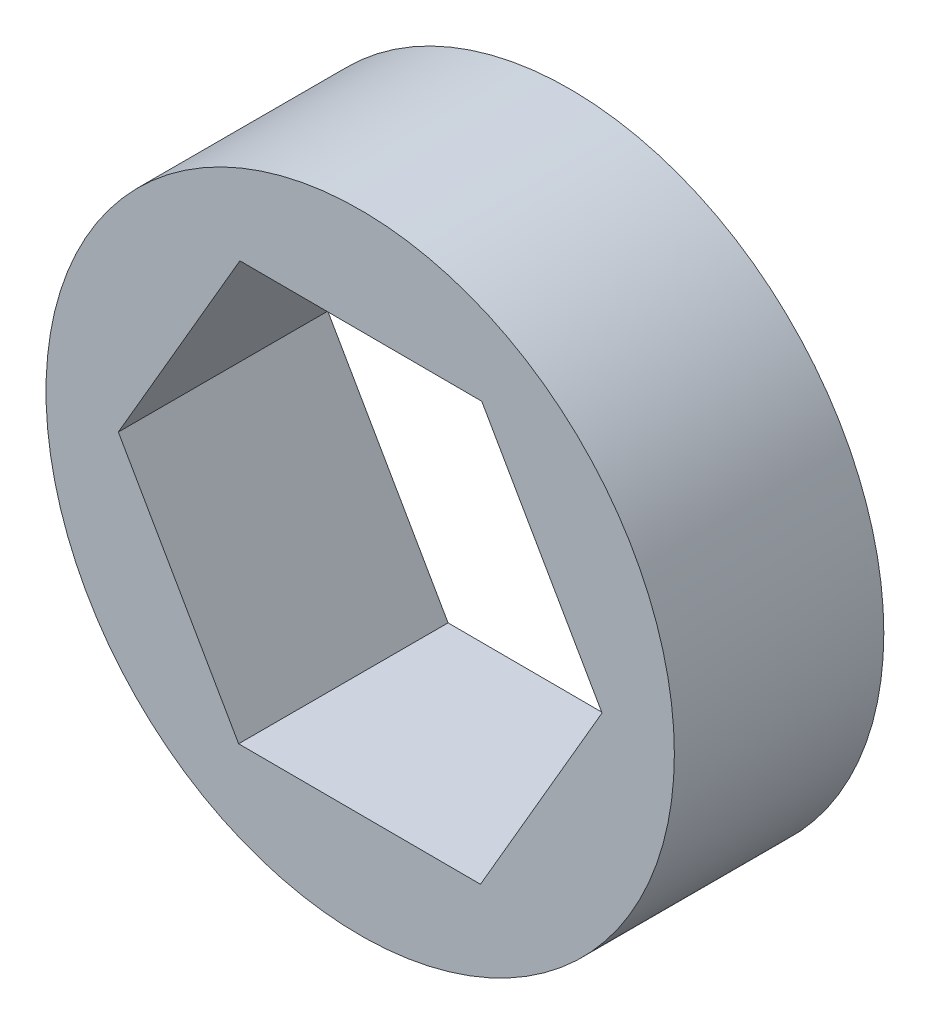
ISO-10303-21;
HEADER;
FILE_DESCRIPTION(('STEP AP214'),'2;1');
FILE_NAME('part.step','',(''),(''),'','','');
FILE_SCHEMA(('AUTOMOTIVE_DESIGN { 1 0 10303 214 1 1 1 1 }'));
ENDSEC;
DATA;
#1=APPLICATION_CONTEXT('core data for automotive mechanical design processes');
#2=APPLICATION_PROTOCOL_DEFINITION('international standard','automotive_design',2000,#1);
#3=PRODUCT_CONTEXT('',#1,'mechanical');
#4=PRODUCT('Part','Part','',(#3));
#5=PRODUCT_RELATED_PRODUCT_CATEGORY('part','',(#4));
#6=PRODUCT_DEFINITION_FORMATION('','',#4);
#7=PRODUCT_DEFINITION_CONTEXT('part definition',#1,'design');
#8=PRODUCT_DEFINITION('design','',#6,#7);
#9=PRODUCT_DEFINITION_SHAPE('','',#8);
#10=(LENGTH_UNIT() NAMED_UNIT(*) SI_UNIT(.MILLI.,.METRE.));
#11=(NAMED_UNIT(*) PLANE_ANGLE_UNIT() SI_UNIT($,.RADIAN.));
#12=(NAMED_UNIT(*) SI_UNIT($,.STERADIAN.) SOLID_ANGLE_UNIT());
#13=UNCERTAINTY_MEASURE_WITH_UNIT(LENGTH_MEASURE(1.E-05),#10,'distance_accuracy_value','');
#14=(GEOMETRIC_REPRESENTATION_CONTEXT(3) GLOBAL_UNCERTAINTY_ASSIGNED_CONTEXT((#13)) GLOBAL_UNIT_ASSIGNED_CONTEXT((#10,
#11,#12)) REPRESENTATION_CONTEXT('',''));
#15=CARTESIAN_POINT('',(0.,0.,0.));
#16=DIRECTION('',(0.,0.,1.));
#17=DIRECTION('',(1.,0.,0.));
#18=AXIS2_PLACEMENT_3D('',#15,#16,#17);
#19=CARTESIAN_POINT('',(0.,0.,6.35));
#20=DIRECTION('',(0.,0.,1.));
#21=DIRECTION('',(1.,0.,0.));
#22=AXIS2_PLACEMENT_3D('',#19,#20,#21);
#23=PLANE('',#22);
#24=CARTESIAN_POINT('',(0.,0.,6.35));
#25=DIRECTION('',(0.,0.,1.));
#26=DIRECTION('',(1.,0.,0.));
#27=AXIS2_PLACEMENT_3D('',#24,#25,#26);
#28=CIRCLE('',#27,9.525);
#29=CARTESIAN_POINT('',(9.525,0.,6.35));
#30=VERTEX_POINT('',#29);
#31=EDGE_CURVE('E11',#30,#30,#28,.T.);
#32=ORIENTED_EDGE('',*,*,#31,.T.);
#33=EDGE_LOOP('',(#32));
#34=FACE_BOUND('',#33,.T.);
#35=DIRECTION('',(0.502611333572125,0.864512491156056,0.));
#36=VECTOR('',#35,1.);
#37=CARTESIAN_POINT('',(3.64699361036975,-6.36103536692381,6.35));
#38=LINE('',#37,#36);
#39=CARTESIAN_POINT('',(3.64699361036975,-6.36103536692381,6.35));
#40=VERTEX_POINT('',#39);
#41=CARTESIAN_POINT('',(7.33231502731217,-0.0221285694421737,6.35));
#42=VERTEX_POINT('',#41);
#43=EDGE_CURVE('E100',#40,#42,#38,.T.);
#44=ORIENTED_EDGE('',*,*,#43,.F.);
#45=DIRECTION('',(0.999995446016177,-0.00301793752540637,0.));
#46=VECTOR('',#45,1.);
#47=CARTESIAN_POINT('',(-3.68532141694241,-6.33890679748164,6.35));
#48=LINE('',#47,#46);
#49=CARTESIAN_POINT('',(-3.68532141694241,-6.33890679748164,6.35));
#50=VERTEX_POINT('',#49);
#51=EDGE_CURVE('E92',#50,#40,#48,.T.);
#52=ORIENTED_EDGE('',*,*,#51,.F.);
#53=DIRECTION('',(0.497384112444053,-0.867530428681462,0.));
#54=VECTOR('',#53,1.);
#55=CARTESIAN_POINT('',(-7.33231502731217,0.022128569442172,6.35));
#56=LINE('',#55,#54);
#57=CARTESIAN_POINT('',(-7.33231502731217,0.022128569442172,6.35));
#58=VERTEX_POINT('',#57);
#59=EDGE_CURVE('E120',#58,#50,#56,.T.);
#60=ORIENTED_EDGE('',*,*,#59,.F.);
#61=DIRECTION('',(-0.502611333572125,-0.864512491156056,0.));
#62=VECTOR('',#61,1.);
#63=CARTESIAN_POINT('',(-3.64699361036976,6.36103536692381,6.35));
#64=LINE('',#63,#62);
#65=CARTESIAN_POINT('',(-3.64699361036976,6.36103536692381,6.35));
#66=VERTEX_POINT('',#65);
#67=EDGE_CURVE('E118',#66,#58,#64,.T.);
#68=ORIENTED_EDGE('',*,*,#67,.F.);
#69=DIRECTION('',(-0.999995446016177,0.00301793752540602,0.));
#70=VECTOR('',#69,1.);
#71=CARTESIAN_POINT('',(3.68532141694241,6.33890679748164,6.35));
#72=LINE('',#71,#70);
#73=CARTESIAN_POINT('',(3.68532141694241,6.33890679748164,6.35));
#74=VERTEX_POINT('',#73);
#75=EDGE_CURVE('E114',#74,#66,#72,.T.);
#76=ORIENTED_EDGE('',*,*,#75,.F.);
#77=DIRECTION('',(-0.497384112444053,0.867530428681462,0.));
#78=VECTOR('',#77,1.);
#79=CARTESIAN_POINT('',(7.33231502731217,-0.0221285694421737,6.35));
#80=LINE('',#79,#78);
#81=EDGE_CURVE('E112',#42,#74,#80,.T.);
#82=ORIENTED_EDGE('',*,*,#81,.F.);
#83=EDGE_LOOP('',(#44,#52,#60,#68,#76,#82));
#84=FACE_BOUND('',#83,.T.);
#85=ADVANCED_FACE('F39',(#34,#84),#23,.T.);
#86=CARTESIAN_POINT('',(0.,0.,0.));
#87=DIRECTION('',(0.,0.,1.));
#88=DIRECTION('',(1.,0.,0.));
#89=AXIS2_PLACEMENT_3D('',#86,#87,#88);
#90=PLANE('',#89);
#91=CARTESIAN_POINT('',(0.,0.,0.));
#92=DIRECTION('',(0.,0.,1.));
#93=DIRECTION('',(1.,0.,0.));
#94=AXIS2_PLACEMENT_3D('',#91,#92,#93);
#95=CIRCLE('',#94,9.525);
#96=CARTESIAN_POINT('',(9.525,0.,0.));
#97=VERTEX_POINT('',#96);
#98=EDGE_CURVE('E43',#97,#97,#95,.T.);
#99=ORIENTED_EDGE('',*,*,#98,.F.);
#100=EDGE_LOOP('',(#99));
#101=FACE_BOUND('',#100,.T.);
#102=DIRECTION('',(0.999995446016177,-0.00301793752540637,0.));
#103=VECTOR('',#102,1.);
#104=CARTESIAN_POINT('',(-3.68532141694241,-6.33890679748164,0.));
#105=LINE('',#104,#103);
#106=CARTESIAN_POINT('',(-3.68532141694241,-6.33890679748164,0.));
#107=VERTEX_POINT('',#106);
#108=CARTESIAN_POINT('',(3.64699361036975,-6.36103536692381,0.));
#109=VERTEX_POINT('',#108);
#110=EDGE_CURVE('E62',#107,#109,#105,.T.);
#111=ORIENTED_EDGE('',*,*,#110,.T.);
#112=DIRECTION('',(0.502611333572125,0.864512491156056,0.));
#113=VECTOR('',#112,1.);
#114=CARTESIAN_POINT('',(3.64699361036975,-6.36103536692381,0.));
#115=LINE('',#114,#113);
#116=CARTESIAN_POINT('',(7.33231502731217,-0.0221285694421737,0.));
#117=VERTEX_POINT('',#116);
#118=EDGE_CURVE('E107',#109,#117,#115,.T.);
#119=ORIENTED_EDGE('',*,*,#118,.T.);
#120=DIRECTION('',(-0.497384112444053,0.867530428681462,0.));
#121=VECTOR('',#120,1.);
#122=CARTESIAN_POINT('',(7.33231502731217,-0.0221285694421737,0.));
#123=LINE('',#122,#121);
#124=CARTESIAN_POINT('',(3.68532141694241,6.33890679748164,0.));
#125=VERTEX_POINT('',#124);
#126=EDGE_CURVE('E124',#117,#125,#123,.T.);
#127=ORIENTED_EDGE('',*,*,#126,.T.);
#128=DIRECTION('',(-0.999995446016177,0.00301793752540602,0.));
#129=VECTOR('',#128,1.);
#130=CARTESIAN_POINT('',(3.68532141694241,6.33890679748164,0.));
#131=LINE('',#130,#129);
#132=CARTESIAN_POINT('',(-3.64699361036976,6.36103536692381,0.));
#133=VERTEX_POINT('',#132);
#134=EDGE_CURVE('E127',#125,#133,#131,.T.);
#135=ORIENTED_EDGE('',*,*,#134,.T.);
#136=DIRECTION('',(-0.502611333572125,-0.864512491156056,0.));
#137=VECTOR('',#136,1.);
#138=CARTESIAN_POINT('',(-3.64699361036976,6.36103536692381,0.));
#139=LINE('',#138,#137);
#140=CARTESIAN_POINT('',(-7.33231502731217,0.022128569442172,0.));
#141=VERTEX_POINT('',#140);
#142=EDGE_CURVE('E130',#133,#141,#139,.T.);
#143=ORIENTED_EDGE('',*,*,#142,.T.);
#144=DIRECTION('',(0.497384112444053,-0.867530428681462,0.));
#145=VECTOR('',#144,1.);
#146=CARTESIAN_POINT('',(-7.33231502731217,0.022128569442172,0.));
#147=LINE('',#146,#145);
#148=EDGE_CURVE('E101',#141,#107,#147,.T.);
#149=ORIENTED_EDGE('',*,*,#148,.T.);
#150=EDGE_LOOP('',(#111,#119,#127,#135,#143,#149));
#151=FACE_BOUND('',#150,.T.);
#152=ADVANCED_FACE('F147',(#101,#151),#90,.F.);
#153=CARTESIAN_POINT('',(0.,0.,6.35));
#154=DIRECTION('',(0.,0.,-1.));
#155=DIRECTION('',(-1.,0.,0.));
#156=AXIS2_PLACEMENT_3D('',#153,#154,#155);
#157=CYLINDRICAL_SURFACE('',#156,9.525);
#158=ORIENTED_EDGE('',*,*,#31,.F.);
#159=EDGE_LOOP('',(#158));
#160=FACE_BOUND('',#159,.T.);
#161=ORIENTED_EDGE('',*,*,#98,.T.);
#162=EDGE_LOOP('',(#161));
#163=FACE_BOUND('',#162,.T.);
#164=ADVANCED_FACE('F41',(#160,#163),#157,.T.);
#165=CARTESIAN_POINT('',(-3.68532141694241,-6.33890679748164,6.35));
#166=DIRECTION('',(0.00301793752540637,0.999995446016177,0.));
#167=DIRECTION('',(-0.999995446016177,0.00301793752540637,0.));
#168=AXIS2_PLACEMENT_3D('',#165,#166,#167);
#169=PLANE('',#168);
#170=ORIENTED_EDGE('',*,*,#110,.F.);
#171=DIRECTION('',(0.,0.,-1.));
#172=VECTOR('',#171,1.);
#173=CARTESIAN_POINT('',(-3.68532141694241,-6.33890679748164,6.35));
#174=LINE('',#173,#172);
#175=EDGE_CURVE('E96',#50,#107,#174,.T.);
#176=ORIENTED_EDGE('',*,*,#175,.F.);
#177=ORIENTED_EDGE('',*,*,#51,.T.);
#178=DIRECTION('',(0.,0.,-1.));
#179=VECTOR('',#178,1.);
#180=CARTESIAN_POINT('',(3.64699361036975,-6.36103536692381,6.35));
#181=LINE('',#180,#179);
#182=EDGE_CURVE('E95',#40,#109,#181,.T.);
#183=ORIENTED_EDGE('',*,*,#182,.T.);
#184=EDGE_LOOP('',(#170,#176,#177,#183));
#185=FACE_BOUND('',#184,.T.);
#186=ADVANCED_FACE('F94',(#185),#169,.T.);
#187=CARTESIAN_POINT('',(3.64699361036975,-6.36103536692381,6.35));
#188=DIRECTION('',(-0.864512491156056,0.502611333572125,0.));
#189=DIRECTION('',(-0.502611333572125,-0.864512491156056,0.));
#190=AXIS2_PLACEMENT_3D('',#187,#188,#189);
#191=PLANE('',#190);
#192=ORIENTED_EDGE('',*,*,#118,.F.);
#193=ORIENTED_EDGE('',*,*,#182,.F.);
#194=ORIENTED_EDGE('',*,*,#43,.T.);
#195=DIRECTION('',(0.,0.,-1.));
#196=VECTOR('',#195,1.);
#197=CARTESIAN_POINT('',(7.33231502731217,-0.0221285694421737,6.35));
#198=LINE('',#197,#196);
#199=EDGE_CURVE('E108',#42,#117,#198,.T.);
#200=ORIENTED_EDGE('',*,*,#199,.T.);
#201=EDGE_LOOP('',(#192,#193,#194,#200));
#202=FACE_BOUND('',#201,.T.);
#203=ADVANCED_FACE('F104',(#202),#191,.T.);
#204=CARTESIAN_POINT('',(7.33231502731217,-0.0221285694421737,6.35));
#205=DIRECTION('',(-0.867530428681462,-0.497384112444053,0.));
#206=DIRECTION('',(0.497384112444053,-0.867530428681462,0.));
#207=AXIS2_PLACEMENT_3D('',#204,#205,#206);
#208=PLANE('',#207);
#209=ORIENTED_EDGE('',*,*,#126,.F.);
#210=ORIENTED_EDGE('',*,*,#199,.F.);
#211=ORIENTED_EDGE('',*,*,#81,.T.);
#212=DIRECTION('',(0.,0.,-1.));
#213=VECTOR('',#212,1.);
#214=CARTESIAN_POINT('',(3.68532141694241,6.33890679748164,6.35));
#215=LINE('',#214,#213);
#216=EDGE_CURVE('E139',#74,#125,#215,.T.);
#217=ORIENTED_EDGE('',*,*,#216,.T.);
#218=EDGE_LOOP('',(#209,#210,#211,#217));
#219=FACE_BOUND('',#218,.T.);
#220=ADVANCED_FACE('F143',(#219),#208,.T.);
#221=CARTESIAN_POINT('',(3.68532141694241,6.33890679748164,6.35));
#222=DIRECTION('',(-0.00301793752540602,-0.999995446016177,0.));
#223=DIRECTION('',(0.999995446016177,-0.00301793752540602,0.));
#224=AXIS2_PLACEMENT_3D('',#221,#222,#223);
#225=PLANE('',#224);
#226=ORIENTED_EDGE('',*,*,#134,.F.);
#227=ORIENTED_EDGE('',*,*,#216,.F.);
#228=ORIENTED_EDGE('',*,*,#75,.T.);
#229=DIRECTION('',(0.,0.,-1.));
#230=VECTOR('',#229,1.);
#231=CARTESIAN_POINT('',(-3.64699361036976,6.36103536692381,6.35));
#232=LINE('',#231,#230);
#233=EDGE_CURVE('E137',#66,#133,#232,.T.);
#234=ORIENTED_EDGE('',*,*,#233,.T.);
#235=EDGE_LOOP('',(#226,#227,#228,#234));
#236=FACE_BOUND('',#235,.T.);
#237=ADVANCED_FACE('F155',(#236),#225,.T.);
#238=CARTESIAN_POINT('',(-3.64699361036976,6.36103536692381,6.35));
#239=DIRECTION('',(0.864512491156056,-0.502611333572125,0.));
#240=DIRECTION('',(0.502611333572125,0.864512491156056,0.));
#241=AXIS2_PLACEMENT_3D('',#238,#239,#240);
#242=PLANE('',#241);
#243=ORIENTED_EDGE('',*,*,#142,.F.);
#244=ORIENTED_EDGE('',*,*,#233,.F.);
#245=ORIENTED_EDGE('',*,*,#67,.T.);
#246=DIRECTION('',(0.,0.,-1.));
#247=VECTOR('',#246,1.);
#248=CARTESIAN_POINT('',(-7.33231502731217,0.022128569442172,6.35));
#249=LINE('',#248,#247);
#250=EDGE_CURVE('E54',#58,#141,#249,.T.);
#251=ORIENTED_EDGE('',*,*,#250,.T.);
#252=EDGE_LOOP('',(#243,#244,#245,#251));
#253=FACE_BOUND('',#252,.T.);
#254=ADVANCED_FACE('F153',(#253),#242,.T.);
#255=CARTESIAN_POINT('',(-7.33231502731217,0.022128569442172,6.35));
#256=DIRECTION('',(0.867530428681462,0.497384112444053,0.));
#257=DIRECTION('',(-0.497384112444053,0.867530428681462,0.));
#258=AXIS2_PLACEMENT_3D('',#255,#256,#257);
#259=PLANE('',#258);
#260=ORIENTED_EDGE('',*,*,#148,.F.);
#261=ORIENTED_EDGE('',*,*,#250,.F.);
#262=ORIENTED_EDGE('',*,*,#59,.T.);
#263=ORIENTED_EDGE('',*,*,#175,.T.);
#264=EDGE_LOOP('',(#260,#261,#262,#263));
#265=FACE_BOUND('',#264,.T.);
#266=ADVANCED_FACE('F149',(#265),#259,.T.);
#267=CLOSED_SHELL('',(#85,#152,#164,#186,#203,#220,#237,#254,#266));
#268=MANIFOLD_SOLID_BREP('B2',#267);
#269=ADVANCED_BREP_SHAPE_REPRESENTATION('',(#18,#268),#14);
#270=SHAPE_DEFINITION_REPRESENTATION(#9,#269);
ENDSEC;
END-ISO-10303-21;
